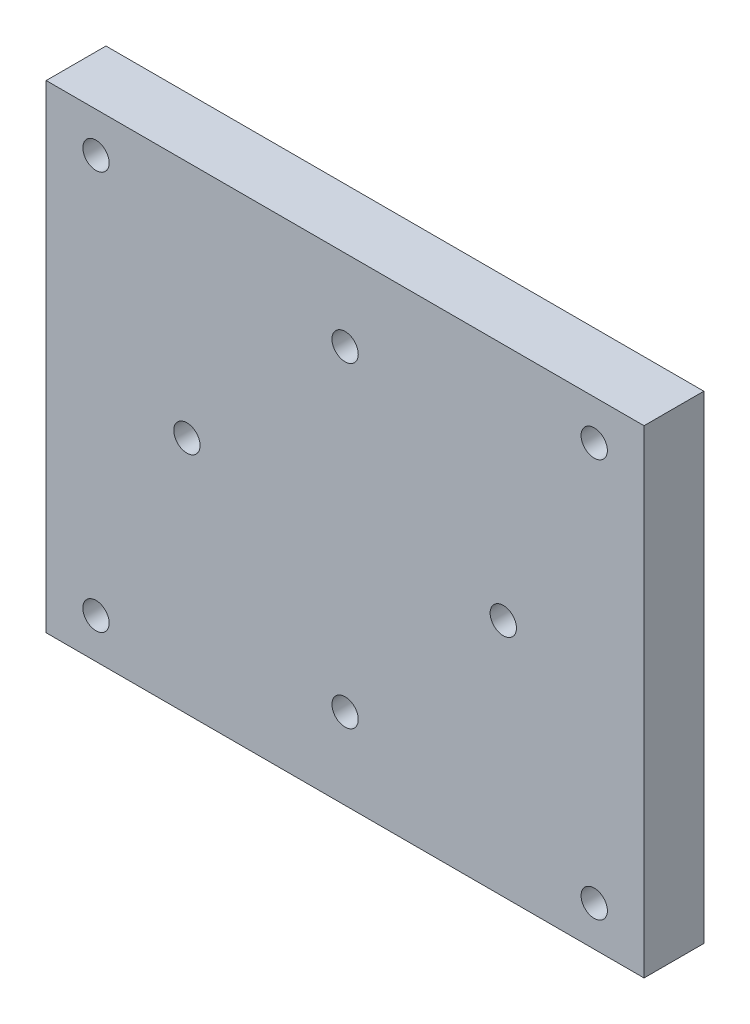
ISO-10303-21;
HEADER;
FILE_DESCRIPTION(('STEP AP214'),'2;1');
FILE_NAME('part.step','',(''),(''),'','','');
FILE_SCHEMA(('AUTOMOTIVE_DESIGN { 1 0 10303 214 1 1 1 1 }'));
ENDSEC;
DATA;
#1=APPLICATION_CONTEXT('core data for automotive mechanical design processes');
#2=APPLICATION_PROTOCOL_DEFINITION('international standard','automotive_design',2000,#1);
#3=PRODUCT_CONTEXT('',#1,'mechanical');
#4=PRODUCT('Part','Part','',(#3));
#5=PRODUCT_RELATED_PRODUCT_CATEGORY('part','',(#4));
#6=PRODUCT_DEFINITION_FORMATION('','',#4);
#7=PRODUCT_DEFINITION_CONTEXT('part definition',#1,'design');
#8=PRODUCT_DEFINITION('design','',#6,#7);
#9=PRODUCT_DEFINITION_SHAPE('','',#8);
#10=(LENGTH_UNIT() NAMED_UNIT(*) SI_UNIT(.MILLI.,.METRE.));
#11=(NAMED_UNIT(*) PLANE_ANGLE_UNIT() SI_UNIT($,.RADIAN.));
#12=(NAMED_UNIT(*) SI_UNIT($,.STERADIAN.) SOLID_ANGLE_UNIT());
#13=UNCERTAINTY_MEASURE_WITH_UNIT(LENGTH_MEASURE(1.E-05),#10,'distance_accuracy_value','');
#14=(GEOMETRIC_REPRESENTATION_CONTEXT(3) GLOBAL_UNCERTAINTY_ASSIGNED_CONTEXT((#13)) GLOBAL_UNIT_ASSIGNED_CONTEXT((#10,
#11,#12)) REPRESENTATION_CONTEXT('',''));
#15=CARTESIAN_POINT('',(0.,0.,0.));
#16=DIRECTION('',(0.,0.,1.));
#17=DIRECTION('',(1.,0.,0.));
#18=AXIS2_PLACEMENT_3D('',#15,#16,#17);
#19=CARTESIAN_POINT('',(15.875,0.,6.));
#20=DIRECTION('',(0.,0.,-1.));
#21=DIRECTION('',(-1.,0.,0.));
#22=AXIS2_PLACEMENT_3D('',#19,#20,#21);
#23=CYLINDRICAL_SURFACE('',#22,1.31999999999984);
#24=CARTESIAN_POINT('',(15.875,0.,6.));
#25=DIRECTION('',(0.,0.,1.));
#26=DIRECTION('',(1.,0.,0.));
#27=AXIS2_PLACEMENT_3D('',#24,#25,#26);
#28=CIRCLE('',#27,1.31999999999984);
#29=CARTESIAN_POINT('',(17.1949999999999,0.,6.));
#30=VERTEX_POINT('',#29);
#31=EDGE_CURVE('E115',#30,#30,#28,.T.);
#32=ORIENTED_EDGE('',*,*,#31,.T.);
#33=EDGE_LOOP('',(#32));
#34=FACE_BOUND('',#33,.T.);
#35=CARTESIAN_POINT('',(15.875,0.,4.));
#36=DIRECTION('',(0.,0.,-1.));
#37=DIRECTION('',(-1.,0.,0.));
#38=AXIS2_PLACEMENT_3D('',#35,#36,#37);
#39=CIRCLE('',#38,1.31999999999984);
#40=CARTESIAN_POINT('',(14.5550000000002,0.,4.));
#41=VERTEX_POINT('',#40);
#42=EDGE_CURVE('E39',#41,#41,#39,.T.);
#43=ORIENTED_EDGE('',*,*,#42,.T.);
#44=EDGE_LOOP('',(#43));
#45=FACE_BOUND('',#44,.T.);
#46=ADVANCED_FACE('F35',(#34,#45),#23,.F.);
#47=CARTESIAN_POINT('',(0.,-15.875,6.));
#48=DIRECTION('',(0.,0.,-1.));
#49=DIRECTION('',(-1.,0.,0.));
#50=AXIS2_PLACEMENT_3D('',#47,#48,#49);
#51=CYLINDRICAL_SURFACE('',#50,1.32);
#52=CARTESIAN_POINT('',(0.,-15.875,6.));
#53=DIRECTION('',(0.,0.,1.));
#54=DIRECTION('',(1.,0.,0.));
#55=AXIS2_PLACEMENT_3D('',#52,#53,#54);
#56=CIRCLE('',#55,1.32);
#57=CARTESIAN_POINT('',(1.32,-15.875,6.));
#58=VERTEX_POINT('',#57);
#59=EDGE_CURVE('E172',#58,#58,#56,.T.);
#60=ORIENTED_EDGE('',*,*,#59,.T.);
#61=EDGE_LOOP('',(#60));
#62=FACE_BOUND('',#61,.T.);
#63=CARTESIAN_POINT('',(0.,-15.875,4.));
#64=DIRECTION('',(0.,0.,-1.));
#65=DIRECTION('',(-1.,0.,0.));
#66=AXIS2_PLACEMENT_3D('',#63,#64,#65);
#67=CIRCLE('',#66,1.32);
#68=CARTESIAN_POINT('',(-1.32,-15.875,4.));
#69=VERTEX_POINT('',#68);
#70=EDGE_CURVE('E121',#69,#69,#67,.T.);
#71=ORIENTED_EDGE('',*,*,#70,.T.);
#72=EDGE_LOOP('',(#71));
#73=FACE_BOUND('',#72,.T.);
#74=ADVANCED_FACE('F201',(#62,#73),#51,.F.);
#75=CARTESIAN_POINT('',(-15.875,0.,6.));
#76=DIRECTION('',(0.,0.,-1.));
#77=DIRECTION('',(-1.,0.,0.));
#78=AXIS2_PLACEMENT_3D('',#75,#76,#77);
#79=CYLINDRICAL_SURFACE('',#78,1.31999999999995);
#80=CARTESIAN_POINT('',(-15.875,0.,6.));
#81=DIRECTION('',(0.,0.,1.));
#82=DIRECTION('',(1.,0.,0.));
#83=AXIS2_PLACEMENT_3D('',#80,#81,#82);
#84=CIRCLE('',#83,1.31999999999995);
#85=CARTESIAN_POINT('',(-14.555,0.,6.));
#86=VERTEX_POINT('',#85);
#87=EDGE_CURVE('E167',#86,#86,#84,.T.);
#88=ORIENTED_EDGE('',*,*,#87,.T.);
#89=EDGE_LOOP('',(#88));
#90=FACE_BOUND('',#89,.T.);
#91=CARTESIAN_POINT('',(-15.875,0.,4.));
#92=DIRECTION('',(0.,0.,-1.));
#93=DIRECTION('',(-1.,0.,0.));
#94=AXIS2_PLACEMENT_3D('',#91,#92,#93);
#95=CIRCLE('',#94,1.31999999999995);
#96=CARTESIAN_POINT('',(-17.1949999999999,0.,4.));
#97=VERTEX_POINT('',#96);
#98=EDGE_CURVE('E117',#97,#97,#95,.T.);
#99=ORIENTED_EDGE('',*,*,#98,.T.);
#100=EDGE_LOOP('',(#99));
#101=FACE_BOUND('',#100,.T.);
#102=ADVANCED_FACE('F207',(#90,#101),#79,.F.);
#103=CARTESIAN_POINT('',(1.08910405714623E-13,15.875,6.));
#104=DIRECTION('',(0.,0.,-1.));
#105=DIRECTION('',(-1.,0.,0.));
#106=AXIS2_PLACEMENT_3D('',#103,#104,#105);
#107=CYLINDRICAL_SURFACE('',#106,1.32);
#108=CARTESIAN_POINT('',(1.08910405714623E-13,15.875,6.));
#109=DIRECTION('',(0.,0.,1.));
#110=DIRECTION('',(1.,0.,0.));
#111=AXIS2_PLACEMENT_3D('',#108,#109,#110);
#112=CIRCLE('',#111,1.32);
#113=CARTESIAN_POINT('',(1.32000000000011,15.875,6.));
#114=VERTEX_POINT('',#113);
#115=EDGE_CURVE('E148',#114,#114,#112,.T.);
#116=ORIENTED_EDGE('',*,*,#115,.T.);
#117=EDGE_LOOP('',(#116));
#118=FACE_BOUND('',#117,.T.);
#119=CARTESIAN_POINT('',(1.08910405714623E-13,15.875,4.));
#120=DIRECTION('',(0.,0.,-1.));
#121=DIRECTION('',(-1.,0.,0.));
#122=AXIS2_PLACEMENT_3D('',#119,#120,#121);
#123=CIRCLE('',#122,1.32);
#124=CARTESIAN_POINT('',(-1.31999999999989,15.875,4.));
#125=VERTEX_POINT('',#124);
#126=EDGE_CURVE('E112',#125,#125,#123,.T.);
#127=ORIENTED_EDGE('',*,*,#126,.T.);
#128=EDGE_LOOP('',(#127));
#129=FACE_BOUND('',#128,.T.);
#130=ADVANCED_FACE('F214',(#118,#129),#107,.F.);
#131=CARTESIAN_POINT('',(0.,0.,6.));
#132=DIRECTION('',(0.,0.,-1.));
#133=DIRECTION('',(-1.,0.,0.));
#134=AXIS2_PLACEMENT_3D('',#131,#132,#133);
#135=PLANE('',#134);
#136=ORIENTED_EDGE('',*,*,#115,.F.);
#137=EDGE_LOOP('',(#136));
#138=FACE_BOUND('',#137,.T.);
#139=CARTESIAN_POINT('',(25.,-20.,6.));
#140=DIRECTION('',(0.,0.,1.));
#141=DIRECTION('',(1.,0.,0.));
#142=AXIS2_PLACEMENT_3D('',#139,#140,#141);
#143=CIRCLE('',#142,1.32);
#144=CARTESIAN_POINT('',(26.32,-20.,6.));
#145=VERTEX_POINT('',#144);
#146=EDGE_CURVE('E158',#145,#145,#143,.T.);
#147=ORIENTED_EDGE('',*,*,#146,.F.);
#148=EDGE_LOOP('',(#147));
#149=FACE_BOUND('',#148,.T.);
#150=ORIENTED_EDGE('',*,*,#87,.F.);
#151=EDGE_LOOP('',(#150));
#152=FACE_BOUND('',#151,.T.);
#153=CARTESIAN_POINT('',(-25.,20.,6.));
#154=DIRECTION('',(0.,0.,1.));
#155=DIRECTION('',(1.,0.,0.));
#156=AXIS2_PLACEMENT_3D('',#153,#154,#155);
#157=CIRCLE('',#156,1.32);
#158=CARTESIAN_POINT('',(-23.68,20.,6.));
#159=VERTEX_POINT('',#158);
#160=EDGE_CURVE('E106',#159,#159,#157,.T.);
#161=ORIENTED_EDGE('',*,*,#160,.F.);
#162=EDGE_LOOP('',(#161));
#163=FACE_BOUND('',#162,.T.);
#164=DIRECTION('',(0.,1.,0.));
#165=VECTOR('',#164,1.);
#166=CARTESIAN_POINT('',(30.,24.,6.));
#167=LINE('',#166,#165);
#168=CARTESIAN_POINT('',(30.,-24.,6.));
#169=VERTEX_POINT('',#168);
#170=CARTESIAN_POINT('',(30.,24.,6.));
#171=VERTEX_POINT('',#170);
#172=EDGE_CURVE('E90',#169,#171,#167,.T.);
#173=ORIENTED_EDGE('',*,*,#172,.T.);
#174=DIRECTION('',(-1.,0.,0.));
#175=VECTOR('',#174,1.);
#176=CARTESIAN_POINT('',(30.,24.,6.));
#177=LINE('',#176,#175);
#178=CARTESIAN_POINT('',(-30.,24.,6.));
#179=VERTEX_POINT('',#178);
#180=EDGE_CURVE('E84',#171,#179,#177,.T.);
#181=ORIENTED_EDGE('',*,*,#180,.T.);
#182=DIRECTION('',(0.,-1.,0.));
#183=VECTOR('',#182,1.);
#184=CARTESIAN_POINT('',(-30.,24.,6.));
#185=LINE('',#184,#183);
#186=CARTESIAN_POINT('',(-30.,-24.,6.));
#187=VERTEX_POINT('',#186);
#188=EDGE_CURVE('E88',#179,#187,#185,.T.);
#189=ORIENTED_EDGE('',*,*,#188,.T.);
#190=DIRECTION('',(1.,0.,0.));
#191=VECTOR('',#190,1.);
#192=CARTESIAN_POINT('',(30.,-24.,6.));
#193=LINE('',#192,#191);
#194=EDGE_CURVE('E54',#187,#169,#193,.T.);
#195=ORIENTED_EDGE('',*,*,#194,.T.);
#196=EDGE_LOOP('',(#173,#181,#189,#195));
#197=FACE_BOUND('',#196,.T.);
#198=ORIENTED_EDGE('',*,*,#59,.F.);
#199=EDGE_LOOP('',(#198));
#200=FACE_BOUND('',#199,.T.);
#201=CARTESIAN_POINT('',(25.,20.,6.));
#202=DIRECTION('',(0.,0.,1.));
#203=DIRECTION('',(1.,0.,0.));
#204=AXIS2_PLACEMENT_3D('',#201,#202,#203);
#205=CIRCLE('',#204,1.32);
#206=CARTESIAN_POINT('',(26.32,20.,6.));
#207=VERTEX_POINT('',#206);
#208=EDGE_CURVE('E164',#207,#207,#205,.T.);
#209=ORIENTED_EDGE('',*,*,#208,.F.);
#210=EDGE_LOOP('',(#209));
#211=FACE_BOUND('',#210,.T.);
#212=CARTESIAN_POINT('',(-25.,-20.,6.));
#213=DIRECTION('',(0.,0.,1.));
#214=DIRECTION('',(1.,0.,0.));
#215=AXIS2_PLACEMENT_3D('',#212,#213,#214);
#216=CIRCLE('',#215,1.32);
#217=CARTESIAN_POINT('',(-23.68,-20.,6.));
#218=VERTEX_POINT('',#217);
#219=EDGE_CURVE('E152',#218,#218,#216,.T.);
#220=ORIENTED_EDGE('',*,*,#219,.F.);
#221=EDGE_LOOP('',(#220));
#222=FACE_BOUND('',#221,.T.);
#223=ORIENTED_EDGE('',*,*,#31,.F.);
#224=EDGE_LOOP('',(#223));
#225=FACE_BOUND('',#224,.T.);
#226=ADVANCED_FACE('F85',(#138,#149,#152,#163,#197,#200,#211,#222,#225),#135,.F.);
#227=CARTESIAN_POINT('',(0.,0.,0.));
#228=DIRECTION('',(0.,0.,-1.));
#229=DIRECTION('',(-1.,0.,0.));
#230=AXIS2_PLACEMENT_3D('',#227,#228,#229);
#231=PLANE('',#230);
#232=CARTESIAN_POINT('',(15.8749999999995,-5.63616123237664E-13,0.));
#233=DIRECTION('',(0.,0.,-1.));
#234=DIRECTION('',(-1.,0.,0.));
#235=AXIS2_PLACEMENT_3D('',#232,#233,#234);
#236=CIRCLE('',#235,3.25000000000073);
#237=CARTESIAN_POINT('',(12.6249999999988,-5.63616123237664E-13,0.));
#238=VERTEX_POINT('',#237);
#239=EDGE_CURVE('E137',#238,#238,#236,.T.);
#240=ORIENTED_EDGE('',*,*,#239,.F.);
#241=EDGE_LOOP('',(#240));
#242=FACE_BOUND('',#241,.T.);
#243=CARTESIAN_POINT('',(-1.01443358717341E-12,-15.875,0.));
#244=DIRECTION('',(0.,0.,-1.));
#245=DIRECTION('',(-1.,0.,0.));
#246=AXIS2_PLACEMENT_3D('',#243,#244,#245);
#247=CIRCLE('',#246,3.25000000000097);
#248=CARTESIAN_POINT('',(-3.25000000000199,-15.875,0.));
#249=VERTEX_POINT('',#248);
#250=EDGE_CURVE('E130',#249,#249,#247,.T.);
#251=ORIENTED_EDGE('',*,*,#250,.F.);
#252=EDGE_LOOP('',(#251));
#253=FACE_BOUND('',#252,.T.);
#254=CARTESIAN_POINT('',(-15.8750000000005,5.61671996444017E-13,0.));
#255=DIRECTION('',(0.,0.,-1.));
#256=DIRECTION('',(-1.,0.,0.));
#257=AXIS2_PLACEMENT_3D('',#254,#255,#256);
#258=CIRCLE('',#257,3.25000000000035);
#259=CARTESIAN_POINT('',(-19.1250000000008,5.61671996444017E-13,0.));
#260=VERTEX_POINT('',#259);
#261=EDGE_CURVE('E123',#260,#260,#258,.T.);
#262=ORIENTED_EDGE('',*,*,#261,.F.);
#263=EDGE_LOOP('',(#262));
#264=FACE_BOUND('',#263,.T.);
#265=CARTESIAN_POINT('',(1.09287578986539E-13,15.875,0.));
#266=DIRECTION('',(0.,0.,-1.));
#267=DIRECTION('',(-1.,0.,0.));
#268=AXIS2_PLACEMENT_3D('',#265,#266,#267);
#269=CIRCLE('',#268,3.25);
#270=CARTESIAN_POINT('',(-3.24999999999989,15.875,0.));
#271=VERTEX_POINT('',#270);
#272=EDGE_CURVE('E119',#271,#271,#269,.T.);
#273=ORIENTED_EDGE('',*,*,#272,.F.);
#274=EDGE_LOOP('',(#273));
#275=FACE_BOUND('',#274,.T.);
#276=CARTESIAN_POINT('',(25.,-20.,0.));
#277=DIRECTION('',(0.,0.,1.));
#278=DIRECTION('',(1.,0.,0.));
#279=AXIS2_PLACEMENT_3D('',#276,#277,#278);
#280=CIRCLE('',#279,1.32);
#281=CARTESIAN_POINT('',(26.32,-20.,0.));
#282=VERTEX_POINT('',#281);
#283=EDGE_CURVE('E155',#282,#282,#280,.T.);
#284=ORIENTED_EDGE('',*,*,#283,.T.);
#285=EDGE_LOOP('',(#284));
#286=FACE_BOUND('',#285,.T.);
#287=CARTESIAN_POINT('',(-25.,20.,0.));
#288=DIRECTION('',(0.,0.,1.));
#289=DIRECTION('',(1.,0.,0.));
#290=AXIS2_PLACEMENT_3D('',#287,#288,#289);
#291=CIRCLE('',#290,1.32);
#292=CARTESIAN_POINT('',(-23.68,20.,0.));
#293=VERTEX_POINT('',#292);
#294=EDGE_CURVE('E175',#293,#293,#291,.T.);
#295=ORIENTED_EDGE('',*,*,#294,.T.);
#296=EDGE_LOOP('',(#295));
#297=FACE_BOUND('',#296,.T.);
#298=DIRECTION('',(0.,1.,0.));
#299=VECTOR('',#298,1.);
#300=CARTESIAN_POINT('',(30.,24.,0.));
#301=LINE('',#300,#299);
#302=CARTESIAN_POINT('',(30.,-24.,0.));
#303=VERTEX_POINT('',#302);
#304=CARTESIAN_POINT('',(30.,24.,0.));
#305=VERTEX_POINT('',#304);
#306=EDGE_CURVE('E103',#303,#305,#301,.T.);
#307=ORIENTED_EDGE('',*,*,#306,.F.);
#308=DIRECTION('',(1.,0.,0.));
#309=VECTOR('',#308,1.);
#310=CARTESIAN_POINT('',(30.,-24.,0.));
#311=LINE('',#310,#309);
#312=CARTESIAN_POINT('',(-30.,-24.,0.));
#313=VERTEX_POINT('',#312);
#314=EDGE_CURVE('E77',#313,#303,#311,.T.);
#315=ORIENTED_EDGE('',*,*,#314,.F.);
#316=DIRECTION('',(0.,-1.,0.));
#317=VECTOR('',#316,1.);
#318=CARTESIAN_POINT('',(-30.,24.,0.));
#319=LINE('',#318,#317);
#320=CARTESIAN_POINT('',(-30.,24.,0.));
#321=VERTEX_POINT('',#320);
#322=EDGE_CURVE('E71',#321,#313,#319,.T.);
#323=ORIENTED_EDGE('',*,*,#322,.F.);
#324=DIRECTION('',(-1.,0.,0.));
#325=VECTOR('',#324,1.);
#326=CARTESIAN_POINT('',(30.,24.,0.));
#327=LINE('',#326,#325);
#328=EDGE_CURVE('E94',#305,#321,#327,.T.);
#329=ORIENTED_EDGE('',*,*,#328,.F.);
#330=EDGE_LOOP('',(#307,#315,#323,#329));
#331=FACE_BOUND('',#330,.T.);
#332=CARTESIAN_POINT('',(25.,20.,0.));
#333=DIRECTION('',(0.,0.,1.));
#334=DIRECTION('',(1.,0.,0.));
#335=AXIS2_PLACEMENT_3D('',#332,#333,#334);
#336=CIRCLE('',#335,1.32);
#337=CARTESIAN_POINT('',(26.32,20.,0.));
#338=VERTEX_POINT('',#337);
#339=EDGE_CURVE('E161',#338,#338,#336,.T.);
#340=ORIENTED_EDGE('',*,*,#339,.T.);
#341=EDGE_LOOP('',(#340));
#342=FACE_BOUND('',#341,.T.);
#343=CARTESIAN_POINT('',(-25.,-20.,0.));
#344=DIRECTION('',(0.,0.,1.));
#345=DIRECTION('',(1.,0.,0.));
#346=AXIS2_PLACEMENT_3D('',#343,#344,#345);
#347=CIRCLE('',#346,1.32);
#348=CARTESIAN_POINT('',(-23.68,-20.,0.));
#349=VERTEX_POINT('',#348);
#350=EDGE_CURVE('E151',#349,#349,#347,.T.);
#351=ORIENTED_EDGE('',*,*,#350,.T.);
#352=EDGE_LOOP('',(#351));
#353=FACE_BOUND('',#352,.T.);
#354=ADVANCED_FACE('F181',(#242,#253,#264,#275,#286,#297,#331,#342,#353),#231,.T.);
#355=CARTESIAN_POINT('',(30.,24.,6.));
#356=DIRECTION('',(-1.,0.,0.));
#357=DIRECTION('',(0.,-1.,0.));
#358=AXIS2_PLACEMENT_3D('',#355,#356,#357);
#359=PLANE('',#358);
#360=ORIENTED_EDGE('',*,*,#306,.T.);
#361=DIRECTION('',(0.,0.,-1.));
#362=VECTOR('',#361,1.);
#363=CARTESIAN_POINT('',(30.,24.,6.));
#364=LINE('',#363,#362);
#365=EDGE_CURVE('E11',#171,#305,#364,.T.);
#366=ORIENTED_EDGE('',*,*,#365,.F.);
#367=ORIENTED_EDGE('',*,*,#172,.F.);
#368=DIRECTION('',(0.,0.,-1.));
#369=VECTOR('',#368,1.);
#370=CARTESIAN_POINT('',(30.,-24.,6.));
#371=LINE('',#370,#369);
#372=EDGE_CURVE('E99',#169,#303,#371,.T.);
#373=ORIENTED_EDGE('',*,*,#372,.T.);
#374=EDGE_LOOP('',(#360,#366,#367,#373));
#375=FACE_BOUND('',#374,.T.);
#376=ADVANCED_FACE('F37',(#375),#359,.F.);
#377=CARTESIAN_POINT('',(30.,24.,6.));
#378=DIRECTION('',(0.,-1.,0.));
#379=DIRECTION('',(1.,0.,0.));
#380=AXIS2_PLACEMENT_3D('',#377,#378,#379);
#381=PLANE('',#380);
#382=ORIENTED_EDGE('',*,*,#328,.T.);
#383=DIRECTION('',(0.,0.,-1.));
#384=VECTOR('',#383,1.);
#385=CARTESIAN_POINT('',(-30.,24.,6.));
#386=LINE('',#385,#384);
#387=EDGE_CURVE('E45',#179,#321,#386,.T.);
#388=ORIENTED_EDGE('',*,*,#387,.F.);
#389=ORIENTED_EDGE('',*,*,#180,.F.);
#390=ORIENTED_EDGE('',*,*,#365,.T.);
#391=EDGE_LOOP('',(#382,#388,#389,#390));
#392=FACE_BOUND('',#391,.T.);
#393=ADVANCED_FACE('F93',(#392),#381,.F.);
#394=CARTESIAN_POINT('',(-30.,24.,6.));
#395=DIRECTION('',(1.,0.,0.));
#396=DIRECTION('',(0.,1.,0.));
#397=AXIS2_PLACEMENT_3D('',#394,#395,#396);
#398=PLANE('',#397);
#399=ORIENTED_EDGE('',*,*,#322,.T.);
#400=DIRECTION('',(0.,0.,-1.));
#401=VECTOR('',#400,1.);
#402=CARTESIAN_POINT('',(-30.,-24.,6.));
#403=LINE('',#402,#401);
#404=EDGE_CURVE('E95',#187,#313,#403,.T.);
#405=ORIENTED_EDGE('',*,*,#404,.F.);
#406=ORIENTED_EDGE('',*,*,#188,.F.);
#407=ORIENTED_EDGE('',*,*,#387,.T.);
#408=EDGE_LOOP('',(#399,#405,#406,#407));
#409=FACE_BOUND('',#408,.T.);
#410=ADVANCED_FACE('F97',(#409),#398,.F.);
#411=CARTESIAN_POINT('',(30.,-24.,6.));
#412=DIRECTION('',(0.,1.,0.));
#413=DIRECTION('',(-1.,0.,0.));
#414=AXIS2_PLACEMENT_3D('',#411,#412,#413);
#415=PLANE('',#414);
#416=ORIENTED_EDGE('',*,*,#314,.T.);
#417=ORIENTED_EDGE('',*,*,#372,.F.);
#418=ORIENTED_EDGE('',*,*,#194,.F.);
#419=ORIENTED_EDGE('',*,*,#404,.T.);
#420=EDGE_LOOP('',(#416,#417,#418,#419));
#421=FACE_BOUND('',#420,.T.);
#422=ADVANCED_FACE('F187',(#421),#415,.F.);
#423=CARTESIAN_POINT('',(-25.,20.,6.));
#424=DIRECTION('',(0.,0.,-1.));
#425=DIRECTION('',(-1.,0.,0.));
#426=AXIS2_PLACEMENT_3D('',#423,#424,#425);
#427=CYLINDRICAL_SURFACE('',#426,1.32);
#428=ORIENTED_EDGE('',*,*,#160,.T.);
#429=EDGE_LOOP('',(#428));
#430=FACE_BOUND('',#429,.T.);
#431=ORIENTED_EDGE('',*,*,#294,.F.);
#432=EDGE_LOOP('',(#431));
#433=FACE_BOUND('',#432,.T.);
#434=ADVANCED_FACE('F184',(#430,#433),#427,.F.);
#435=CARTESIAN_POINT('',(25.,20.,6.));
#436=DIRECTION('',(0.,0.,-1.));
#437=DIRECTION('',(-1.,0.,0.));
#438=AXIS2_PLACEMENT_3D('',#435,#436,#437);
#439=CYLINDRICAL_SURFACE('',#438,1.32);
#440=ORIENTED_EDGE('',*,*,#208,.T.);
#441=EDGE_LOOP('',(#440));
#442=FACE_BOUND('',#441,.T.);
#443=ORIENTED_EDGE('',*,*,#339,.F.);
#444=EDGE_LOOP('',(#443));
#445=FACE_BOUND('',#444,.T.);
#446=ADVANCED_FACE('F186',(#442,#445),#439,.F.);
#447=CARTESIAN_POINT('',(25.,-20.,6.));
#448=DIRECTION('',(0.,0.,-1.));
#449=DIRECTION('',(-1.,0.,0.));
#450=AXIS2_PLACEMENT_3D('',#447,#448,#449);
#451=CYLINDRICAL_SURFACE('',#450,1.32);
#452=ORIENTED_EDGE('',*,*,#146,.T.);
#453=EDGE_LOOP('',(#452));
#454=FACE_BOUND('',#453,.T.);
#455=ORIENTED_EDGE('',*,*,#283,.F.);
#456=EDGE_LOOP('',(#455));
#457=FACE_BOUND('',#456,.T.);
#458=ADVANCED_FACE('F194',(#454,#457),#451,.F.);
#459=CARTESIAN_POINT('',(-25.,-20.,6.));
#460=DIRECTION('',(0.,0.,-1.));
#461=DIRECTION('',(-1.,0.,0.));
#462=AXIS2_PLACEMENT_3D('',#459,#460,#461);
#463=CYLINDRICAL_SURFACE('',#462,1.32);
#464=ORIENTED_EDGE('',*,*,#219,.T.);
#465=EDGE_LOOP('',(#464));
#466=FACE_BOUND('',#465,.T.);
#467=ORIENTED_EDGE('',*,*,#350,.F.);
#468=EDGE_LOOP('',(#467));
#469=FACE_BOUND('',#468,.T.);
#470=ADVANCED_FACE('F218',(#466,#469),#463,.F.);
#471=CARTESIAN_POINT('',(1.09287578986539E-13,15.875,4.));
#472=DIRECTION('',(0.,0.,-1.));
#473=DIRECTION('',(-1.,0.,0.));
#474=AXIS2_PLACEMENT_3D('',#471,#472,#473);
#475=CYLINDRICAL_SURFACE('',#474,3.25);
#476=CARTESIAN_POINT('',(1.09287578986539E-13,15.875,4.));
#477=DIRECTION('',(0.,0.,-1.));
#478=DIRECTION('',(-1.,0.,0.));
#479=AXIS2_PLACEMENT_3D('',#476,#477,#478);
#480=CIRCLE('',#479,3.25);
#481=CARTESIAN_POINT('',(-3.24999999999989,15.875,4.));
#482=VERTEX_POINT('',#481);
#483=EDGE_CURVE('E116',#482,#482,#480,.T.);
#484=ORIENTED_EDGE('',*,*,#483,.F.);
#485=EDGE_LOOP('',(#484));
#486=FACE_BOUND('',#485,.T.);
#487=ORIENTED_EDGE('',*,*,#272,.T.);
#488=EDGE_LOOP('',(#487));
#489=FACE_BOUND('',#488,.T.);
#490=ADVANCED_FACE('F212',(#486,#489),#475,.F.);
#491=CARTESIAN_POINT('',(1.09287578986539E-13,15.875,4.));
#492=DIRECTION('',(0.,0.,-1.));
#493=DIRECTION('',(-1.,0.,0.));
#494=AXIS2_PLACEMENT_3D('',#491,#492,#493);
#495=PLANE('',#494);
#496=ORIENTED_EDGE('',*,*,#126,.F.);
#497=EDGE_LOOP('',(#496));
#498=FACE_BOUND('',#497,.T.);
#499=ORIENTED_EDGE('',*,*,#483,.T.);
#500=EDGE_LOOP('',(#499));
#501=FACE_BOUND('',#500,.T.);
#502=ADVANCED_FACE('F243',(#498,#501),#495,.T.);
#503=CARTESIAN_POINT('',(-15.8750000000005,5.61671996444017E-13,4.));
#504=DIRECTION('',(0.,0.,-1.));
#505=DIRECTION('',(-1.,0.,0.));
#506=AXIS2_PLACEMENT_3D('',#503,#504,#505);
#507=CYLINDRICAL_SURFACE('',#506,3.25000000000035);
#508=CARTESIAN_POINT('',(-15.8750000000005,5.61671996444017E-13,4.));
#509=DIRECTION('',(0.,0.,-1.));
#510=DIRECTION('',(-1.,0.,0.));
#511=AXIS2_PLACEMENT_3D('',#508,#509,#510);
#512=CIRCLE('',#511,3.25000000000035);
#513=CARTESIAN_POINT('',(-19.1250000000008,5.61671996444017E-13,4.));
#514=VERTEX_POINT('',#513);
#515=EDGE_CURVE('E120',#514,#514,#512,.T.);
#516=ORIENTED_EDGE('',*,*,#515,.F.);
#517=EDGE_LOOP('',(#516));
#518=FACE_BOUND('',#517,.T.);
#519=ORIENTED_EDGE('',*,*,#261,.T.);
#520=EDGE_LOOP('',(#519));
#521=FACE_BOUND('',#520,.T.);
#522=ADVANCED_FACE('F237',(#518,#521),#507,.F.);
#523=CARTESIAN_POINT('',(-15.8750000000005,5.61671996444017E-13,4.));
#524=DIRECTION('',(0.,0.,-1.));
#525=DIRECTION('',(-1.,0.,0.));
#526=AXIS2_PLACEMENT_3D('',#523,#524,#525);
#527=PLANE('',#526);
#528=ORIENTED_EDGE('',*,*,#98,.F.);
#529=EDGE_LOOP('',(#528));
#530=FACE_BOUND('',#529,.T.);
#531=ORIENTED_EDGE('',*,*,#515,.T.);
#532=EDGE_LOOP('',(#531));
#533=FACE_BOUND('',#532,.T.);
#534=ADVANCED_FACE('F233',(#530,#533),#527,.T.);
#535=CARTESIAN_POINT('',(-1.01443358717341E-12,-15.875,4.));
#536=DIRECTION('',(0.,0.,-1.));
#537=DIRECTION('',(-1.,0.,0.));
#538=AXIS2_PLACEMENT_3D('',#535,#536,#537);
#539=CYLINDRICAL_SURFACE('',#538,3.25000000000097);
#540=CARTESIAN_POINT('',(-1.01443358717341E-12,-15.875,4.));
#541=DIRECTION('',(0.,0.,-1.));
#542=DIRECTION('',(-1.,0.,0.));
#543=AXIS2_PLACEMENT_3D('',#540,#541,#542);
#544=CIRCLE('',#543,3.25000000000097);
#545=CARTESIAN_POINT('',(-3.25000000000199,-15.875,4.));
#546=VERTEX_POINT('',#545);
#547=EDGE_CURVE('E124',#546,#546,#544,.T.);
#548=ORIENTED_EDGE('',*,*,#547,.F.);
#549=EDGE_LOOP('',(#548));
#550=FACE_BOUND('',#549,.T.);
#551=ORIENTED_EDGE('',*,*,#250,.T.);
#552=EDGE_LOOP('',(#551));
#553=FACE_BOUND('',#552,.T.);
#554=ADVANCED_FACE('F236',(#550,#553),#539,.F.);
#555=CARTESIAN_POINT('',(-1.01443358717341E-12,-15.875,4.));
#556=DIRECTION('',(0.,0.,-1.));
#557=DIRECTION('',(-1.,0.,0.));
#558=AXIS2_PLACEMENT_3D('',#555,#556,#557);
#559=PLANE('',#558);
#560=ORIENTED_EDGE('',*,*,#70,.F.);
#561=EDGE_LOOP('',(#560));
#562=FACE_BOUND('',#561,.T.);
#563=ORIENTED_EDGE('',*,*,#547,.T.);
#564=EDGE_LOOP('',(#563));
#565=FACE_BOUND('',#564,.T.);
#566=ADVANCED_FACE('F270',(#562,#565),#559,.T.);
#567=CARTESIAN_POINT('',(15.8749999999995,-5.63616123237664E-13,4.));
#568=DIRECTION('',(0.,0.,-1.));
#569=DIRECTION('',(-1.,0.,0.));
#570=AXIS2_PLACEMENT_3D('',#567,#568,#569);
#571=CYLINDRICAL_SURFACE('',#570,3.25000000000073);
#572=CARTESIAN_POINT('',(15.8749999999995,-5.63616123237664E-13,4.));
#573=DIRECTION('',(0.,0.,-1.));
#574=DIRECTION('',(-1.,0.,0.));
#575=AXIS2_PLACEMENT_3D('',#572,#573,#574);
#576=CIRCLE('',#575,3.25000000000073);
#577=CARTESIAN_POINT('',(12.6249999999988,-5.63616123237664E-13,4.));
#578=VERTEX_POINT('',#577);
#579=EDGE_CURVE('E289',#578,#578,#576,.T.);
#580=ORIENTED_EDGE('',*,*,#579,.F.);
#581=EDGE_LOOP('',(#580));
#582=FACE_BOUND('',#581,.T.);
#583=ORIENTED_EDGE('',*,*,#239,.T.);
#584=EDGE_LOOP('',(#583));
#585=FACE_BOUND('',#584,.T.);
#586=ADVANCED_FACE('F274',(#582,#585),#571,.F.);
#587=CARTESIAN_POINT('',(15.8749999999995,-5.63616123237664E-13,4.));
#588=DIRECTION('',(0.,0.,-1.));
#589=DIRECTION('',(-1.,0.,0.));
#590=AXIS2_PLACEMENT_3D('',#587,#588,#589);
#591=PLANE('',#590);
#592=ORIENTED_EDGE('',*,*,#42,.F.);
#593=EDGE_LOOP('',(#592));
#594=FACE_BOUND('',#593,.T.);
#595=ORIENTED_EDGE('',*,*,#579,.T.);
#596=EDGE_LOOP('',(#595));
#597=FACE_BOUND('',#596,.T.);
#598=ADVANCED_FACE('F278',(#594,#597),#591,.T.);
#599=CLOSED_SHELL('',(#46,#74,#102,#130,#226,#354,#376,#393,#410,#422,#434,#446,#458,#470,#490,
#502,#522,#534,#554,#566,#586,#598));
#600=MANIFOLD_SOLID_BREP('B2',#599);
#601=ADVANCED_BREP_SHAPE_REPRESENTATION('',(#18,#600),#14);
#602=SHAPE_DEFINITION_REPRESENTATION(#9,#601);
ENDSEC;
END-ISO-10303-21;
